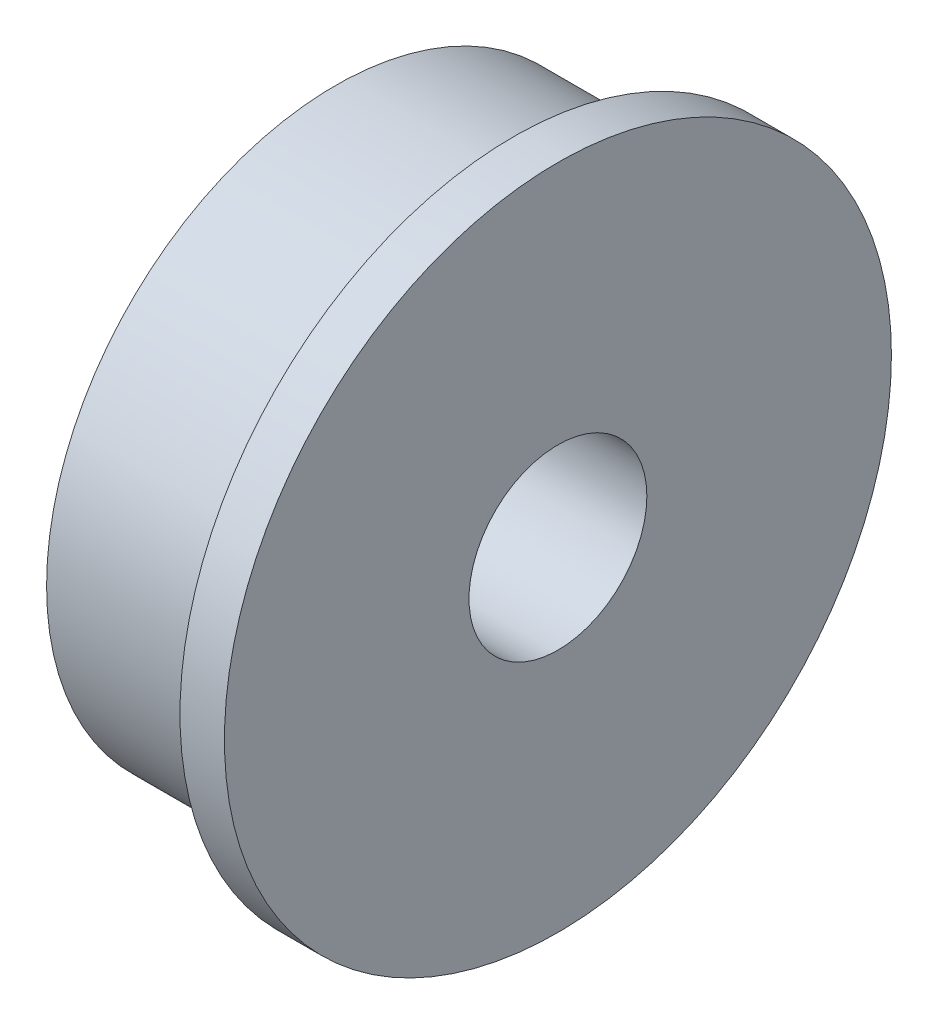
ISO-10303-21;
HEADER;
FILE_DESCRIPTION(('STEP AP214'),'2;1');
FILE_NAME('part.step','',(''),(''),'','','');
FILE_SCHEMA(('AUTOMOTIVE_DESIGN { 1 0 10303 214 1 1 1 1 }'));
ENDSEC;
DATA;
#1=APPLICATION_CONTEXT('core data for automotive mechanical design processes');
#2=APPLICATION_PROTOCOL_DEFINITION('international standard','automotive_design',2000,#1);
#3=PRODUCT_CONTEXT('',#1,'mechanical');
#4=PRODUCT('Part','Part','',(#3));
#5=PRODUCT_RELATED_PRODUCT_CATEGORY('part','',(#4));
#6=PRODUCT_DEFINITION_FORMATION('','',#4);
#7=PRODUCT_DEFINITION_CONTEXT('part definition',#1,'design');
#8=PRODUCT_DEFINITION('design','',#6,#7);
#9=PRODUCT_DEFINITION_SHAPE('','',#8);
#10=(LENGTH_UNIT() NAMED_UNIT(*) SI_UNIT(.MILLI.,.METRE.));
#11=(NAMED_UNIT(*) PLANE_ANGLE_UNIT() SI_UNIT($,.RADIAN.));
#12=(NAMED_UNIT(*) SI_UNIT($,.STERADIAN.) SOLID_ANGLE_UNIT());
#13=UNCERTAINTY_MEASURE_WITH_UNIT(LENGTH_MEASURE(1.E-05),#10,'distance_accuracy_value','');
#14=(GEOMETRIC_REPRESENTATION_CONTEXT(3) GLOBAL_UNCERTAINTY_ASSIGNED_CONTEXT((#13)) GLOBAL_UNIT_ASSIGNED_CONTEXT((#10,
#11,#12)) REPRESENTATION_CONTEXT('',''));
#15=CARTESIAN_POINT('',(0.,0.,0.));
#16=DIRECTION('',(0.,0.,1.));
#17=DIRECTION('',(1.,0.,0.));
#18=AXIS2_PLACEMENT_3D('',#15,#16,#17);
#19=CARTESIAN_POINT('',(-0.585185185185185,2.,0.));
#20=DIRECTION('',(1.,0.,0.));
#21=DIRECTION('',(0.,0.,-1.));
#22=AXIS2_PLACEMENT_3D('',#19,#20,#21);
#23=PLANE('',#22);
#24=CARTESIAN_POINT('',(-0.585185185185185,0.,0.));
#25=DIRECTION('',(1.,0.,0.));
#26=DIRECTION('',(0.,0.,-1.));
#27=AXIS2_PLACEMENT_3D('',#24,#25,#26);
#28=CIRCLE('',#27,7.5);
#29=CARTESIAN_POINT('',(-0.585185185185185,0.,-7.5));
#30=VERTEX_POINT('',#29);
#31=EDGE_CURVE('E10',#30,#30,#28,.T.);
#32=ORIENTED_EDGE('',*,*,#31,.T.);
#33=EDGE_LOOP('',(#32));
#34=FACE_BOUND('',#33,.T.);
#35=CARTESIAN_POINT('',(-0.585185185185185,0.,0.));
#36=DIRECTION('',(1.,0.,0.));
#37=DIRECTION('',(0.,0.,-1.));
#38=AXIS2_PLACEMENT_3D('',#35,#36,#37);
#39=CIRCLE('',#38,2.);
#40=CARTESIAN_POINT('',(-0.585185185185185,0.,-2.));
#41=VERTEX_POINT('',#40);
#42=EDGE_CURVE('E53',#41,#41,#39,.T.);
#43=ORIENTED_EDGE('',*,*,#42,.F.);
#44=EDGE_LOOP('',(#43));
#45=FACE_BOUND('',#44,.T.);
#46=ADVANCED_FACE('F31',(#34,#45),#23,.T.);
#47=CARTESIAN_POINT('',(0.,0.,0.));
#48=DIRECTION('',(1.,0.,0.));
#49=DIRECTION('',(0.,0.,-1.));
#50=AXIS2_PLACEMENT_3D('',#47,#48,#49);
#51=CYLINDRICAL_SURFACE('',#50,7.5);
#52=CARTESIAN_POINT('',(-1.58518518518519,0.,0.));
#53=DIRECTION('',(1.,0.,0.));
#54=DIRECTION('',(0.,0.,-1.));
#55=AXIS2_PLACEMENT_3D('',#52,#53,#54);
#56=CIRCLE('',#55,7.5);
#57=CARTESIAN_POINT('',(-1.58518518518519,0.,-7.5));
#58=VERTEX_POINT('',#57);
#59=EDGE_CURVE('E37',#58,#58,#56,.T.);
#60=ORIENTED_EDGE('',*,*,#59,.T.);
#61=EDGE_LOOP('',(#60));
#62=FACE_BOUND('',#61,.T.);
#63=ORIENTED_EDGE('',*,*,#31,.F.);
#64=EDGE_LOOP('',(#63));
#65=FACE_BOUND('',#64,.T.);
#66=ADVANCED_FACE('F61',(#62,#65),#51,.T.);
#67=CARTESIAN_POINT('',(-1.58518518518519,7.5,0.));
#68=DIRECTION('',(-1.,0.,0.));
#69=DIRECTION('',(0.,0.,1.));
#70=AXIS2_PLACEMENT_3D('',#67,#68,#69);
#71=PLANE('',#70);
#72=CARTESIAN_POINT('',(-1.58518518518519,0.,0.));
#73=DIRECTION('',(1.,0.,0.));
#74=DIRECTION('',(0.,0.,-1.));
#75=AXIS2_PLACEMENT_3D('',#72,#73,#74);
#76=CIRCLE('',#75,6.5);
#77=CARTESIAN_POINT('',(-1.58518518518519,0.,-6.5));
#78=VERTEX_POINT('',#77);
#79=EDGE_CURVE('E41',#78,#78,#76,.T.);
#80=ORIENTED_EDGE('',*,*,#79,.T.);
#81=EDGE_LOOP('',(#80));
#82=FACE_BOUND('',#81,.T.);
#83=ORIENTED_EDGE('',*,*,#59,.F.);
#84=EDGE_LOOP('',(#83));
#85=FACE_BOUND('',#84,.T.);
#86=ADVANCED_FACE('F65',(#82,#85),#71,.T.);
#87=CARTESIAN_POINT('',(0.,0.,0.));
#88=DIRECTION('',(1.,0.,0.));
#89=DIRECTION('',(0.,0.,-1.));
#90=AXIS2_PLACEMENT_3D('',#87,#88,#89);
#91=CYLINDRICAL_SURFACE('',#90,6.5);
#92=CARTESIAN_POINT('',(-5.58518518518519,0.,0.));
#93=DIRECTION('',(1.,0.,0.));
#94=DIRECTION('',(0.,0.,-1.));
#95=AXIS2_PLACEMENT_3D('',#92,#93,#94);
#96=CIRCLE('',#95,6.5);
#97=CARTESIAN_POINT('',(-5.58518518518519,0.,-6.5));
#98=VERTEX_POINT('',#97);
#99=EDGE_CURVE('E45',#98,#98,#96,.T.);
#100=ORIENTED_EDGE('',*,*,#99,.T.);
#101=EDGE_LOOP('',(#100));
#102=FACE_BOUND('',#101,.T.);
#103=ORIENTED_EDGE('',*,*,#79,.F.);
#104=EDGE_LOOP('',(#103));
#105=FACE_BOUND('',#104,.T.);
#106=ADVANCED_FACE('F69',(#102,#105),#91,.T.);
#107=CARTESIAN_POINT('',(-5.58518518518519,6.5,0.));
#108=DIRECTION('',(-1.,0.,0.));
#109=DIRECTION('',(0.,0.,1.));
#110=AXIS2_PLACEMENT_3D('',#107,#108,#109);
#111=PLANE('',#110);
#112=CARTESIAN_POINT('',(-5.58518518518519,0.,0.));
#113=DIRECTION('',(1.,0.,0.));
#114=DIRECTION('',(0.,0.,-1.));
#115=AXIS2_PLACEMENT_3D('',#112,#113,#114);
#116=CIRCLE('',#115,2.);
#117=CARTESIAN_POINT('',(-5.58518518518519,0.,-2.));
#118=VERTEX_POINT('',#117);
#119=EDGE_CURVE('E50',#118,#118,#116,.T.);
#120=ORIENTED_EDGE('',*,*,#119,.T.);
#121=EDGE_LOOP('',(#120));
#122=FACE_BOUND('',#121,.T.);
#123=ORIENTED_EDGE('',*,*,#99,.F.);
#124=EDGE_LOOP('',(#123));
#125=FACE_BOUND('',#124,.T.);
#126=ADVANCED_FACE('F76',(#122,#125),#111,.T.);
#127=CARTESIAN_POINT('',(0.,0.,0.));
#128=DIRECTION('',(1.,0.,0.));
#129=DIRECTION('',(0.,0.,-1.));
#130=AXIS2_PLACEMENT_3D('',#127,#128,#129);
#131=CYLINDRICAL_SURFACE('',#130,2.);
#132=ORIENTED_EDGE('',*,*,#42,.T.);
#133=EDGE_LOOP('',(#132));
#134=FACE_BOUND('',#133,.T.);
#135=ORIENTED_EDGE('',*,*,#119,.F.);
#136=EDGE_LOOP('',(#135));
#137=FACE_BOUND('',#136,.T.);
#138=ADVANCED_FACE('F57',(#134,#137),#131,.F.);
#139=CLOSED_SHELL('',(#46,#66,#86,#106,#126,#138));
#140=MANIFOLD_SOLID_BREP('B2',#139);
#141=ADVANCED_BREP_SHAPE_REPRESENTATION('',(#18,#140),#14);
#142=SHAPE_DEFINITION_REPRESENTATION(#9,#141);
ENDSEC;
END-ISO-10303-21;
